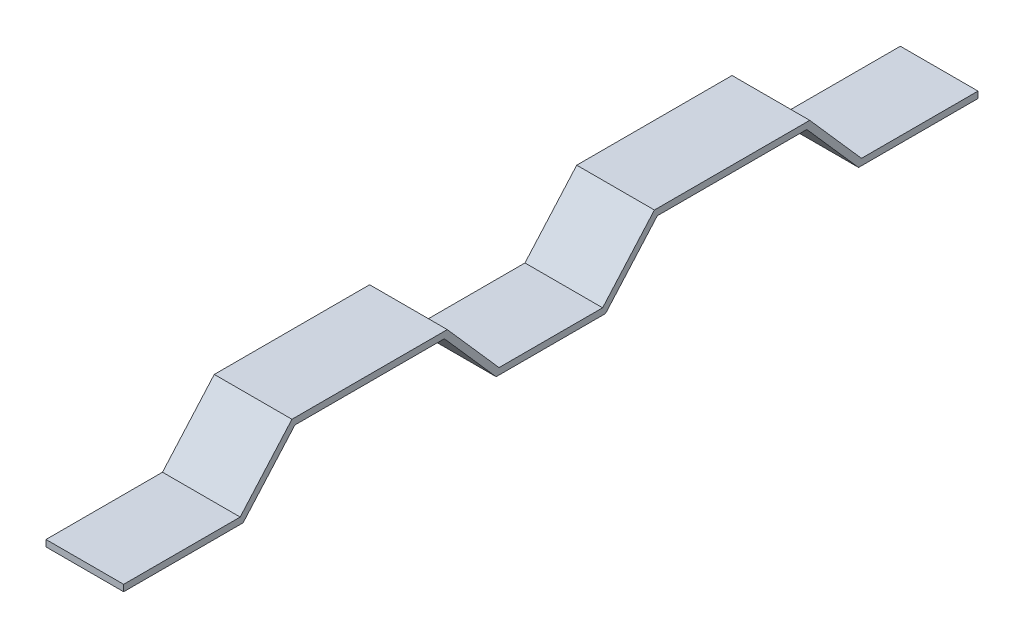
ISO-10303-21;
HEADER;
FILE_DESCRIPTION(('STEP AP214'),'2;1');
FILE_NAME('part.step','',(''),(''),'','','');
FILE_SCHEMA(('AUTOMOTIVE_DESIGN { 1 0 10303 214 1 1 1 1 }'));
ENDSEC;
DATA;
#1=APPLICATION_CONTEXT('core data for automotive mechanical design processes');
#2=APPLICATION_PROTOCOL_DEFINITION('international standard','automotive_design',2000,#1);
#3=PRODUCT_CONTEXT('',#1,'mechanical');
#4=PRODUCT('Part','Part','',(#3));
#5=PRODUCT_RELATED_PRODUCT_CATEGORY('part','',(#4));
#6=PRODUCT_DEFINITION_FORMATION('','',#4);
#7=PRODUCT_DEFINITION_CONTEXT('part definition',#1,'design');
#8=PRODUCT_DEFINITION('design','',#6,#7);
#9=PRODUCT_DEFINITION_SHAPE('','',#8);
#10=(LENGTH_UNIT() NAMED_UNIT(*) SI_UNIT(.MILLI.,.METRE.));
#11=(NAMED_UNIT(*) PLANE_ANGLE_UNIT() SI_UNIT($,.RADIAN.));
#12=(NAMED_UNIT(*) SI_UNIT($,.STERADIAN.) SOLID_ANGLE_UNIT());
#13=UNCERTAINTY_MEASURE_WITH_UNIT(LENGTH_MEASURE(1.E-05),#10,'distance_accuracy_value','');
#14=(GEOMETRIC_REPRESENTATION_CONTEXT(3) GLOBAL_UNCERTAINTY_ASSIGNED_CONTEXT((#13)) GLOBAL_UNIT_ASSIGNED_CONTEXT((#10,
#11,#12)) REPRESENTATION_CONTEXT('',''));
#15=CARTESIAN_POINT('',(0.,0.,0.));
#16=DIRECTION('',(0.,0.,1.));
#17=DIRECTION('',(1.,0.,0.));
#18=AXIS2_PLACEMENT_3D('',#15,#16,#17);
#19=CARTESIAN_POINT('',(38.1,-3.175,174.463559322034));
#20=DIRECTION('',(0.,0.,-1.));
#21=DIRECTION('',(-1.,0.,0.));
#22=AXIS2_PLACEMENT_3D('',#19,#20,#21);
#23=PLANE('',#22);
#24=DIRECTION('',(0.,-1.,0.));
#25=VECTOR('',#24,1.);
#26=CARTESIAN_POINT('',(0.,-3.175,174.463559322034));
#27=LINE('',#26,#25);
#28=CARTESIAN_POINT('',(0.,0.,174.463559322034));
#29=VERTEX_POINT('',#28);
#30=CARTESIAN_POINT('',(0.,-3.175,174.463559322034));
#31=VERTEX_POINT('',#30);
#32=EDGE_CURVE('E202',#29,#31,#27,.T.);
#33=ORIENTED_EDGE('',*,*,#32,.T.);
#34=DIRECTION('',(-1.,0.,0.));
#35=VECTOR('',#34,1.);
#36=CARTESIAN_POINT('',(38.1,-3.175,174.463559322034));
#37=LINE('',#36,#35);
#38=CARTESIAN_POINT('',(38.1,-3.175,174.463559322034));
#39=VERTEX_POINT('',#38);
#40=EDGE_CURVE('E11',#39,#31,#37,.T.);
#41=ORIENTED_EDGE('',*,*,#40,.F.);
#42=DIRECTION('',(0.,-1.,0.));
#43=VECTOR('',#42,1.);
#44=CARTESIAN_POINT('',(38.1,-3.175,174.463559322034));
#45=LINE('',#44,#43);
#46=CARTESIAN_POINT('',(38.1,0.,174.463559322034));
#47=VERTEX_POINT('',#46);
#48=EDGE_CURVE('E240',#47,#39,#45,.T.);
#49=ORIENTED_EDGE('',*,*,#48,.F.);
#50=DIRECTION('',(-1.,0.,0.));
#51=VECTOR('',#50,1.);
#52=CARTESIAN_POINT('',(38.1,0.,174.463559322034));
#53=LINE('',#52,#51);
#54=EDGE_CURVE('E198',#47,#29,#53,.T.);
#55=ORIENTED_EDGE('',*,*,#54,.T.);
#56=EDGE_LOOP('',(#33,#41,#49,#55));
#57=FACE_BOUND('',#56,.T.);
#58=ADVANCED_FACE('F34',(#57),#23,.F.);
#59=CARTESIAN_POINT('',(38.1,-3.175,174.463559322034));
#60=DIRECTION('',(0.,1.,0.));
#61=DIRECTION('',(0.,0.,1.));
#62=AXIS2_PLACEMENT_3D('',#59,#60,#61);
#63=PLANE('',#62);
#64=DIRECTION('',(0.,0.,-1.));
#65=VECTOR('',#64,1.);
#66=CARTESIAN_POINT('',(0.,-3.175,174.463559322034));
#67=LINE('',#66,#65);
#68=CARTESIAN_POINT('',(0.,-3.175,115.878892615579));
#69=VERTEX_POINT('',#68);
#70=EDGE_CURVE('E205',#31,#69,#67,.T.);
#71=ORIENTED_EDGE('',*,*,#70,.T.);
#72=DIRECTION('',(-1.,0.,0.));
#73=VECTOR('',#72,1.);
#74=CARTESIAN_POINT('',(38.1,-3.175,115.878892615579));
#75=LINE('',#74,#73);
#76=CARTESIAN_POINT('',(38.1,-3.175,115.878892615579));
#77=VERTEX_POINT('',#76);
#78=EDGE_CURVE('E42',#77,#69,#75,.T.);
#79=ORIENTED_EDGE('',*,*,#78,.F.);
#80=DIRECTION('',(0.,0.,-1.));
#81=VECTOR('',#80,1.);
#82=CARTESIAN_POINT('',(38.1,-3.175,174.463559322034));
#83=LINE('',#82,#81);
#84=EDGE_CURVE('E129',#39,#77,#83,.T.);
#85=ORIENTED_EDGE('',*,*,#84,.F.);
#86=ORIENTED_EDGE('',*,*,#40,.T.);
#87=EDGE_LOOP('',(#71,#79,#85,#86));
#88=FACE_BOUND('',#87,.T.);
#89=ADVANCED_FACE('F358',(#88),#63,.F.);
#90=CARTESIAN_POINT('',(38.1,-3.175,115.878892615579));
#91=DIRECTION('',(0.,0.660880367939409,0.750491265287126));
#92=DIRECTION('',(0.,-0.750491265287126,0.660880367939409));
#93=AXIS2_PLACEMENT_3D('',#90,#91,#92);
#94=PLANE('',#93);
#95=DIRECTION('',(0.,0.750491265287126,-0.660880367939409));
#96=VECTOR('',#95,1.);
#97=CARTESIAN_POINT('',(0.,-3.175,115.878892615579));
#98=LINE('',#97,#96);
#99=CARTESIAN_POINT('',(0.,25.6690677966102,90.4788926155794));
#100=VERTEX_POINT('',#99);
#101=EDGE_CURVE('E207',#69,#100,#98,.T.);
#102=ORIENTED_EDGE('',*,*,#101,.T.);
#103=DIRECTION('',(-1.,0.,0.));
#104=VECTOR('',#103,1.);
#105=CARTESIAN_POINT('',(38.1,25.6690677966102,90.4788926155794));
#106=LINE('',#105,#104);
#107=CARTESIAN_POINT('',(38.1,25.6690677966102,90.4788926155794));
#108=VERTEX_POINT('',#107);
#109=EDGE_CURVE('E283',#108,#100,#106,.T.);
#110=ORIENTED_EDGE('',*,*,#109,.F.);
#111=DIRECTION('',(0.,0.750491265287126,-0.660880367939409));
#112=VECTOR('',#111,1.);
#113=CARTESIAN_POINT('',(38.1,-3.175,115.878892615579));
#114=LINE('',#113,#112);
#115=EDGE_CURVE('E291',#77,#108,#114,.T.);
#116=ORIENTED_EDGE('',*,*,#115,.F.);
#117=ORIENTED_EDGE('',*,*,#78,.T.);
#118=EDGE_LOOP('',(#102,#110,#116,#117));
#119=FACE_BOUND('',#118,.T.);
#120=ADVANCED_FACE('F289',(#119),#94,.F.);
#121=CARTESIAN_POINT('',(38.1,25.6690677966102,90.4788926155794));
#122=DIRECTION('',(0.,1.,0.));
#123=DIRECTION('',(0.,0.,1.));
#124=AXIS2_PLACEMENT_3D('',#121,#122,#123);
#125=PLANE('',#124);
#126=DIRECTION('',(0.,0.,-1.));
#127=VECTOR('',#126,1.);
#128=CARTESIAN_POINT('',(0.,25.6690677966102,90.4788926155794));
#129=LINE('',#128,#127);
#130=CARTESIAN_POINT('',(0.,25.6690677966102,17.1482260284884));
#131=VERTEX_POINT('',#130);
#132=EDGE_CURVE('E209',#100,#131,#129,.T.);
#133=ORIENTED_EDGE('',*,*,#132,.T.);
#134=DIRECTION('',(-1.,0.,0.));
#135=VECTOR('',#134,1.);
#136=CARTESIAN_POINT('',(38.1,25.6690677966102,17.1482260284884));
#137=LINE('',#136,#135);
#138=CARTESIAN_POINT('',(38.1,25.6690677966102,17.1482260284884));
#139=VERTEX_POINT('',#138);
#140=EDGE_CURVE('E280',#139,#131,#137,.T.);
#141=ORIENTED_EDGE('',*,*,#140,.F.);
#142=DIRECTION('',(0.,0.,-1.));
#143=VECTOR('',#142,1.);
#144=CARTESIAN_POINT('',(38.1,25.6690677966102,90.4788926155794));
#145=LINE('',#144,#143);
#146=EDGE_CURVE('E309',#108,#139,#145,.T.);
#147=ORIENTED_EDGE('',*,*,#146,.F.);
#148=ORIENTED_EDGE('',*,*,#109,.T.);
#149=EDGE_LOOP('',(#133,#141,#147,#148));
#150=FACE_BOUND('',#149,.T.);
#151=ADVANCED_FACE('F300',(#150),#125,.F.);
#152=CARTESIAN_POINT('',(38.1,25.6690677966102,17.1482260284884));
#153=DIRECTION('',(0.,0.660880367939409,-0.750491265287126));
#154=DIRECTION('',(0.,0.750491265287126,0.660880367939409));
#155=AXIS2_PLACEMENT_3D('',#152,#153,#154);
#156=PLANE('',#155);
#157=DIRECTION('',(0.,-0.750491265287126,-0.660880367939409));
#158=VECTOR('',#157,1.);
#159=CARTESIAN_POINT('',(0.,25.6690677966102,17.1482260284884));
#160=LINE('',#159,#158);
#161=CARTESIAN_POINT('',(0.,-3.175,-8.25177397151158));
#162=VERTEX_POINT('',#161);
#163=EDGE_CURVE('E211',#131,#162,#160,.T.);
#164=ORIENTED_EDGE('',*,*,#163,.T.);
#165=DIRECTION('',(-1.,0.,0.));
#166=VECTOR('',#165,1.);
#167=CARTESIAN_POINT('',(38.1,-3.175,-8.25177397151158));
#168=LINE('',#167,#166);
#169=CARTESIAN_POINT('',(38.1,-3.175,-8.25177397151158));
#170=VERTEX_POINT('',#169);
#171=EDGE_CURVE('E277',#170,#162,#168,.T.);
#172=ORIENTED_EDGE('',*,*,#171,.F.);
#173=DIRECTION('',(0.,-0.750491265287126,-0.660880367939409));
#174=VECTOR('',#173,1.);
#175=CARTESIAN_POINT('',(38.1,25.6690677966102,17.1482260284884));
#176=LINE('',#175,#174);
#177=EDGE_CURVE('E306',#139,#170,#176,.T.);
#178=ORIENTED_EDGE('',*,*,#177,.F.);
#179=ORIENTED_EDGE('',*,*,#140,.T.);
#180=EDGE_LOOP('',(#164,#172,#178,#179));
#181=FACE_BOUND('',#180,.T.);
#182=ADVANCED_FACE('F304',(#181),#156,.F.);
#183=CARTESIAN_POINT('',(38.1,-3.175,-8.25177397151158));
#184=DIRECTION('',(0.,1.,0.));
#185=DIRECTION('',(0.,0.,1.));
#186=AXIS2_PLACEMENT_3D('',#183,#184,#185);
#187=PLANE('',#186);
#188=DIRECTION('',(0.,0.,-1.));
#189=VECTOR('',#188,1.);
#190=CARTESIAN_POINT('',(0.,-3.175,-8.25177397151158));
#191=LINE('',#190,#189);
#192=CARTESIAN_POINT('',(0.,-3.175,-61.9211073844206));
#193=VERTEX_POINT('',#192);
#194=EDGE_CURVE('E213',#162,#193,#191,.T.);
#195=ORIENTED_EDGE('',*,*,#194,.T.);
#196=DIRECTION('',(-1.,0.,0.));
#197=VECTOR('',#196,1.);
#198=CARTESIAN_POINT('',(38.1,-3.175,-61.9211073844206));
#199=LINE('',#198,#197);
#200=CARTESIAN_POINT('',(38.1,-3.175,-61.9211073844206));
#201=VERTEX_POINT('',#200);
#202=EDGE_CURVE('E274',#201,#193,#199,.T.);
#203=ORIENTED_EDGE('',*,*,#202,.F.);
#204=DIRECTION('',(0.,0.,-1.));
#205=VECTOR('',#204,1.);
#206=CARTESIAN_POINT('',(38.1,-3.175,-8.25177397151158));
#207=LINE('',#206,#205);
#208=EDGE_CURVE('E308',#170,#201,#207,.T.);
#209=ORIENTED_EDGE('',*,*,#208,.F.);
#210=ORIENTED_EDGE('',*,*,#171,.T.);
#211=EDGE_LOOP('',(#195,#203,#209,#210));
#212=FACE_BOUND('',#211,.T.);
#213=ADVANCED_FACE('F371',(#212),#187,.F.);
#214=CARTESIAN_POINT('',(38.1,-3.175,-61.9211073844206));
#215=DIRECTION('',(0.,0.660880367939409,0.750491265287126));
#216=DIRECTION('',(0.,-0.750491265287126,0.660880367939409));
#217=AXIS2_PLACEMENT_3D('',#214,#215,#216);
#218=PLANE('',#217);
#219=DIRECTION('',(0.,0.750491265287126,-0.660880367939409));
#220=VECTOR('',#219,1.);
#221=CARTESIAN_POINT('',(0.,-3.175,-61.9211073844206));
#222=LINE('',#221,#220);
#223=CARTESIAN_POINT('',(0.,25.6690677966102,-87.3211073844206));
#224=VERTEX_POINT('',#223);
#225=EDGE_CURVE('E215',#193,#224,#222,.T.);
#226=ORIENTED_EDGE('',*,*,#225,.T.);
#227=DIRECTION('',(-1.,0.,0.));
#228=VECTOR('',#227,1.);
#229=CARTESIAN_POINT('',(38.1,25.6690677966102,-87.3211073844206));
#230=LINE('',#229,#228);
#231=CARTESIAN_POINT('',(38.1,25.6690677966102,-87.3211073844206));
#232=VERTEX_POINT('',#231);
#233=EDGE_CURVE('E271',#232,#224,#230,.T.);
#234=ORIENTED_EDGE('',*,*,#233,.F.);
#235=DIRECTION('',(0.,0.750491265287126,-0.660880367939409));
#236=VECTOR('',#235,1.);
#237=CARTESIAN_POINT('',(38.1,-3.175,-61.9211073844206));
#238=LINE('',#237,#236);
#239=EDGE_CURVE('E311',#201,#232,#238,.T.);
#240=ORIENTED_EDGE('',*,*,#239,.F.);
#241=ORIENTED_EDGE('',*,*,#202,.T.);
#242=EDGE_LOOP('',(#226,#234,#240,#241));
#243=FACE_BOUND('',#242,.T.);
#244=ADVANCED_FACE('F374',(#243),#218,.F.);
#245=CARTESIAN_POINT('',(38.1,25.6690677966102,-87.3211073844206));
#246=DIRECTION('',(0.,1.,0.));
#247=DIRECTION('',(0.,0.,1.));
#248=AXIS2_PLACEMENT_3D('',#245,#246,#247);
#249=PLANE('',#248);
#250=DIRECTION('',(0.,0.,-1.));
#251=VECTOR('',#250,1.);
#252=CARTESIAN_POINT('',(0.,25.6690677966102,-87.3211073844206));
#253=LINE('',#252,#251);
#254=CARTESIAN_POINT('',(0.,25.6690677966102,-160.651773971512));
#255=VERTEX_POINT('',#254);
#256=EDGE_CURVE('E217',#224,#255,#253,.T.);
#257=ORIENTED_EDGE('',*,*,#256,.T.);
#258=DIRECTION('',(-1.,0.,0.));
#259=VECTOR('',#258,1.);
#260=CARTESIAN_POINT('',(38.1,25.6690677966102,-160.651773971512));
#261=LINE('',#260,#259);
#262=CARTESIAN_POINT('',(38.1,25.6690677966102,-160.651773971512));
#263=VERTEX_POINT('',#262);
#264=EDGE_CURVE('E268',#263,#255,#261,.T.);
#265=ORIENTED_EDGE('',*,*,#264,.F.);
#266=DIRECTION('',(0.,0.,-1.));
#267=VECTOR('',#266,1.);
#268=CARTESIAN_POINT('',(38.1,25.6690677966102,-87.3211073844206));
#269=LINE('',#268,#267);
#270=EDGE_CURVE('E317',#232,#263,#269,.T.);
#271=ORIENTED_EDGE('',*,*,#270,.F.);
#272=ORIENTED_EDGE('',*,*,#233,.T.);
#273=EDGE_LOOP('',(#257,#265,#271,#272));
#274=FACE_BOUND('',#273,.T.);
#275=ADVANCED_FACE('F378',(#274),#249,.F.);
#276=CARTESIAN_POINT('',(38.1,25.6690677966102,-160.651773971512));
#277=DIRECTION('',(0.,0.660880367939409,-0.750491265287126));
#278=DIRECTION('',(0.,0.750491265287126,0.660880367939409));
#279=AXIS2_PLACEMENT_3D('',#276,#277,#278);
#280=PLANE('',#279);
#281=DIRECTION('',(0.,-0.750491265287126,-0.660880367939409));
#282=VECTOR('',#281,1.);
#283=CARTESIAN_POINT('',(0.,25.6690677966102,-160.651773971512));
#284=LINE('',#283,#282);
#285=CARTESIAN_POINT('',(0.,-3.175,-186.051773971512));
#286=VERTEX_POINT('',#285);
#287=EDGE_CURVE('E219',#255,#286,#284,.T.);
#288=ORIENTED_EDGE('',*,*,#287,.T.);
#289=DIRECTION('',(-1.,0.,0.));
#290=VECTOR('',#289,1.);
#291=CARTESIAN_POINT('',(38.1,-3.175,-186.051773971512));
#292=LINE('',#291,#290);
#293=CARTESIAN_POINT('',(38.1,-3.175,-186.051773971512));
#294=VERTEX_POINT('',#293);
#295=EDGE_CURVE('E265',#294,#286,#292,.T.);
#296=ORIENTED_EDGE('',*,*,#295,.F.);
#297=DIRECTION('',(0.,-0.750491265287126,-0.660880367939409));
#298=VECTOR('',#297,1.);
#299=CARTESIAN_POINT('',(38.1,25.6690677966102,-160.651773971512));
#300=LINE('',#299,#298);
#301=EDGE_CURVE('E319',#263,#294,#300,.T.);
#302=ORIENTED_EDGE('',*,*,#301,.F.);
#303=ORIENTED_EDGE('',*,*,#264,.T.);
#304=EDGE_LOOP('',(#288,#296,#302,#303));
#305=FACE_BOUND('',#304,.T.);
#306=ADVANCED_FACE('F382',(#305),#280,.F.);
#307=CARTESIAN_POINT('',(38.1,-3.175,-186.051773971512));
#308=DIRECTION('',(0.,1.,0.));
#309=DIRECTION('',(0.,0.,1.));
#310=AXIS2_PLACEMENT_3D('',#307,#308,#309);
#311=PLANE('',#310);
#312=DIRECTION('',(0.,0.,-1.));
#313=VECTOR('',#312,1.);
#314=CARTESIAN_POINT('',(0.,-3.175,-186.051773971512));
#315=LINE('',#314,#313);
#316=CARTESIAN_POINT('',(0.,-3.175,-244.636440677966));
#317=VERTEX_POINT('',#316);
#318=EDGE_CURVE('E221',#286,#317,#315,.T.);
#319=ORIENTED_EDGE('',*,*,#318,.T.);
#320=DIRECTION('',(-1.,0.,0.));
#321=VECTOR('',#320,1.);
#322=CARTESIAN_POINT('',(38.1,-3.175,-244.636440677966));
#323=LINE('',#322,#321);
#324=CARTESIAN_POINT('',(38.1,-3.175,-244.636440677966));
#325=VERTEX_POINT('',#324);
#326=EDGE_CURVE('E262',#325,#317,#323,.T.);
#327=ORIENTED_EDGE('',*,*,#326,.F.);
#328=DIRECTION('',(0.,0.,-1.));
#329=VECTOR('',#328,1.);
#330=CARTESIAN_POINT('',(38.1,-3.175,-186.051773971512));
#331=LINE('',#330,#329);
#332=EDGE_CURVE('E321',#294,#325,#331,.T.);
#333=ORIENTED_EDGE('',*,*,#332,.F.);
#334=ORIENTED_EDGE('',*,*,#295,.T.);
#335=EDGE_LOOP('',(#319,#327,#333,#334));
#336=FACE_BOUND('',#335,.T.);
#337=ADVANCED_FACE('F386',(#336),#311,.F.);
#338=CARTESIAN_POINT('',(38.1,-3.175,-244.636440677966));
#339=DIRECTION('',(0.,0.,1.));
#340=DIRECTION('',(1.,0.,0.));
#341=AXIS2_PLACEMENT_3D('',#338,#339,#340);
#342=PLANE('',#341);
#343=DIRECTION('',(0.,1.,0.));
#344=VECTOR('',#343,1.);
#345=CARTESIAN_POINT('',(0.,-3.175,-244.636440677966));
#346=LINE('',#345,#344);
#347=CARTESIAN_POINT('',(0.,0.,-244.636440677966));
#348=VERTEX_POINT('',#347);
#349=EDGE_CURVE('E223',#317,#348,#346,.T.);
#350=ORIENTED_EDGE('',*,*,#349,.T.);
#351=DIRECTION('',(-1.,0.,0.));
#352=VECTOR('',#351,1.);
#353=CARTESIAN_POINT('',(38.1,0.,-244.636440677966));
#354=LINE('',#353,#352);
#355=CARTESIAN_POINT('',(38.1,0.,-244.636440677966));
#356=VERTEX_POINT('',#355);
#357=EDGE_CURVE('E259',#356,#348,#354,.T.);
#358=ORIENTED_EDGE('',*,*,#357,.F.);
#359=DIRECTION('',(0.,1.,0.));
#360=VECTOR('',#359,1.);
#361=CARTESIAN_POINT('',(38.1,-3.175,-244.636440677966));
#362=LINE('',#361,#360);
#363=EDGE_CURVE('E323',#325,#356,#362,.T.);
#364=ORIENTED_EDGE('',*,*,#363,.F.);
#365=ORIENTED_EDGE('',*,*,#326,.T.);
#366=EDGE_LOOP('',(#350,#358,#364,#365));
#367=FACE_BOUND('',#366,.T.);
#368=ADVANCED_FACE('F390',(#367),#342,.F.);
#369=CARTESIAN_POINT('',(38.1,0.,-187.486440677966));
#370=DIRECTION('',(0.,-1.,0.));
#371=DIRECTION('',(0.,0.,-1.));
#372=AXIS2_PLACEMENT_3D('',#369,#370,#371);
#373=PLANE('',#372);
#374=DIRECTION('',(0.,0.,1.));
#375=VECTOR('',#374,1.);
#376=CARTESIAN_POINT('',(0.,0.,-187.486440677966));
#377=LINE('',#376,#375);
#378=CARTESIAN_POINT('',(0.,0.,-187.486440677966));
#379=VERTEX_POINT('',#378);
#380=EDGE_CURVE('E225',#348,#379,#377,.T.);
#381=ORIENTED_EDGE('',*,*,#380,.T.);
#382=DIRECTION('',(-1.,0.,0.));
#383=VECTOR('',#382,1.);
#384=CARTESIAN_POINT('',(38.1,0.,-187.486440677966));
#385=LINE('',#384,#383);
#386=CARTESIAN_POINT('',(38.1,0.,-187.486440677966));
#387=VERTEX_POINT('',#386);
#388=EDGE_CURVE('E256',#387,#379,#385,.T.);
#389=ORIENTED_EDGE('',*,*,#388,.F.);
#390=DIRECTION('',(0.,0.,1.));
#391=VECTOR('',#390,1.);
#392=CARTESIAN_POINT('',(38.1,0.,-187.486440677966));
#393=LINE('',#392,#391);
#394=EDGE_CURVE('E325',#356,#387,#393,.T.);
#395=ORIENTED_EDGE('',*,*,#394,.F.);
#396=ORIENTED_EDGE('',*,*,#357,.T.);
#397=EDGE_LOOP('',(#381,#389,#395,#396));
#398=FACE_BOUND('',#397,.T.);
#399=ADVANCED_FACE('F394',(#398),#373,.F.);
#400=CARTESIAN_POINT('',(38.1,28.8440677966102,-162.086440677966));
#401=DIRECTION('',(0.,-0.660880367939409,0.750491265287126));
#402=DIRECTION('',(0.,-0.750491265287126,-0.660880367939409));
#403=AXIS2_PLACEMENT_3D('',#400,#401,#402);
#404=PLANE('',#403);
#405=DIRECTION('',(0.,0.750491265287126,0.660880367939409));
#406=VECTOR('',#405,1.);
#407=CARTESIAN_POINT('',(0.,28.8440677966102,-162.086440677966));
#408=LINE('',#407,#406);
#409=CARTESIAN_POINT('',(0.,28.8440677966102,-162.086440677966));
#410=VERTEX_POINT('',#409);
#411=EDGE_CURVE('E227',#379,#410,#408,.T.);
#412=ORIENTED_EDGE('',*,*,#411,.T.);
#413=DIRECTION('',(-1.,0.,0.));
#414=VECTOR('',#413,1.);
#415=CARTESIAN_POINT('',(38.1,28.8440677966102,-162.086440677966));
#416=LINE('',#415,#414);
#417=CARTESIAN_POINT('',(38.1,28.8440677966102,-162.086440677966));
#418=VERTEX_POINT('',#417);
#419=EDGE_CURVE('E253',#418,#410,#416,.T.);
#420=ORIENTED_EDGE('',*,*,#419,.F.);
#421=DIRECTION('',(0.,0.750491265287126,0.660880367939409));
#422=VECTOR('',#421,1.);
#423=CARTESIAN_POINT('',(38.1,28.8440677966102,-162.086440677966));
#424=LINE('',#423,#422);
#425=EDGE_CURVE('E327',#387,#418,#424,.T.);
#426=ORIENTED_EDGE('',*,*,#425,.F.);
#427=ORIENTED_EDGE('',*,*,#388,.T.);
#428=EDGE_LOOP('',(#412,#420,#426,#427));
#429=FACE_BOUND('',#428,.T.);
#430=ADVANCED_FACE('F398',(#429),#404,.F.);
#431=CARTESIAN_POINT('',(38.1,28.8440677966102,-85.8864406779661));
#432=DIRECTION('',(0.,-1.,0.));
#433=DIRECTION('',(0.,0.,-1.));
#434=AXIS2_PLACEMENT_3D('',#431,#432,#433);
#435=PLANE('',#434);
#436=DIRECTION('',(0.,0.,1.));
#437=VECTOR('',#436,1.);
#438=CARTESIAN_POINT('',(0.,28.8440677966102,-85.8864406779661));
#439=LINE('',#438,#437);
#440=CARTESIAN_POINT('',(0.,28.8440677966102,-85.8864406779661));
#441=VERTEX_POINT('',#440);
#442=EDGE_CURVE('E229',#410,#441,#439,.T.);
#443=ORIENTED_EDGE('',*,*,#442,.T.);
#444=DIRECTION('',(-1.,0.,0.));
#445=VECTOR('',#444,1.);
#446=CARTESIAN_POINT('',(38.1,28.8440677966102,-85.8864406779661));
#447=LINE('',#446,#445);
#448=CARTESIAN_POINT('',(38.1,28.8440677966102,-85.8864406779661));
#449=VERTEX_POINT('',#448);
#450=EDGE_CURVE('E250',#449,#441,#447,.T.);
#451=ORIENTED_EDGE('',*,*,#450,.F.);
#452=DIRECTION('',(0.,0.,1.));
#453=VECTOR('',#452,1.);
#454=CARTESIAN_POINT('',(38.1,28.8440677966102,-85.8864406779661));
#455=LINE('',#454,#453);
#456=EDGE_CURVE('E329',#418,#449,#455,.T.);
#457=ORIENTED_EDGE('',*,*,#456,.F.);
#458=ORIENTED_EDGE('',*,*,#419,.T.);
#459=EDGE_LOOP('',(#443,#451,#457,#458));
#460=FACE_BOUND('',#459,.T.);
#461=ADVANCED_FACE('F402',(#460),#435,.F.);
#462=CARTESIAN_POINT('',(38.1,0.,-60.4864406779661));
#463=DIRECTION('',(0.,-0.660880367939409,-0.750491265287126));
#464=DIRECTION('',(0.,0.750491265287126,-0.660880367939409));
#465=AXIS2_PLACEMENT_3D('',#462,#463,#464);
#466=PLANE('',#465);
#467=DIRECTION('',(0.,-0.750491265287126,0.660880367939409));
#468=VECTOR('',#467,1.);
#469=CARTESIAN_POINT('',(0.,0.,-60.4864406779661));
#470=LINE('',#469,#468);
#471=CARTESIAN_POINT('',(0.,0.,-60.4864406779661));
#472=VERTEX_POINT('',#471);
#473=EDGE_CURVE('E231',#441,#472,#470,.T.);
#474=ORIENTED_EDGE('',*,*,#473,.T.);
#475=DIRECTION('',(-1.,0.,0.));
#476=VECTOR('',#475,1.);
#477=CARTESIAN_POINT('',(38.1,0.,-60.4864406779661));
#478=LINE('',#477,#476);
#479=CARTESIAN_POINT('',(38.1,0.,-60.4864406779661));
#480=VERTEX_POINT('',#479);
#481=EDGE_CURVE('E247',#480,#472,#478,.T.);
#482=ORIENTED_EDGE('',*,*,#481,.F.);
#483=DIRECTION('',(0.,-0.750491265287126,0.660880367939409));
#484=VECTOR('',#483,1.);
#485=CARTESIAN_POINT('',(38.1,0.,-60.4864406779661));
#486=LINE('',#485,#484);
#487=EDGE_CURVE('E331',#449,#480,#486,.T.);
#488=ORIENTED_EDGE('',*,*,#487,.F.);
#489=ORIENTED_EDGE('',*,*,#450,.T.);
#490=EDGE_LOOP('',(#474,#482,#488,#489));
#491=FACE_BOUND('',#490,.T.);
#492=ADVANCED_FACE('F406',(#491),#466,.F.);
#493=CARTESIAN_POINT('',(38.1,0.,-9.68644067796611));
#494=DIRECTION('',(0.,-1.,0.));
#495=DIRECTION('',(0.,0.,-1.));
#496=AXIS2_PLACEMENT_3D('',#493,#494,#495);
#497=PLANE('',#496);
#498=DIRECTION('',(0.,0.,1.));
#499=VECTOR('',#498,1.);
#500=CARTESIAN_POINT('',(0.,0.,-9.68644067796611));
#501=LINE('',#500,#499);
#502=CARTESIAN_POINT('',(0.,0.,-9.68644067796611));
#503=VERTEX_POINT('',#502);
#504=EDGE_CURVE('E233',#472,#503,#501,.T.);
#505=ORIENTED_EDGE('',*,*,#504,.T.);
#506=DIRECTION('',(-1.,0.,0.));
#507=VECTOR('',#506,1.);
#508=CARTESIAN_POINT('',(38.1,0.,-9.68644067796611));
#509=LINE('',#508,#507);
#510=CARTESIAN_POINT('',(38.1,0.,-9.68644067796611));
#511=VERTEX_POINT('',#510);
#512=EDGE_CURVE('E244',#511,#503,#509,.T.);
#513=ORIENTED_EDGE('',*,*,#512,.F.);
#514=DIRECTION('',(0.,0.,1.));
#515=VECTOR('',#514,1.);
#516=CARTESIAN_POINT('',(38.1,0.,-9.68644067796611));
#517=LINE('',#516,#515);
#518=EDGE_CURVE('E333',#480,#511,#517,.T.);
#519=ORIENTED_EDGE('',*,*,#518,.F.);
#520=ORIENTED_EDGE('',*,*,#481,.T.);
#521=EDGE_LOOP('',(#505,#513,#519,#520));
#522=FACE_BOUND('',#521,.T.);
#523=ADVANCED_FACE('F339',(#522),#497,.F.);
#524=CARTESIAN_POINT('',(38.1,28.8440677966102,15.7135593220339));
#525=DIRECTION('',(0.,-0.660880367939409,0.750491265287126));
#526=DIRECTION('',(0.,-0.750491265287126,-0.660880367939409));
#527=AXIS2_PLACEMENT_3D('',#524,#525,#526);
#528=PLANE('',#527);
#529=DIRECTION('',(0.,0.750491265287126,0.660880367939409));
#530=VECTOR('',#529,1.);
#531=CARTESIAN_POINT('',(0.,28.8440677966102,15.7135593220339));
#532=LINE('',#531,#530);
#533=CARTESIAN_POINT('',(0.,28.8440677966102,15.7135593220339));
#534=VERTEX_POINT('',#533);
#535=EDGE_CURVE('E235',#503,#534,#532,.T.);
#536=ORIENTED_EDGE('',*,*,#535,.T.);
#537=DIRECTION('',(-1.,0.,0.));
#538=VECTOR('',#537,1.);
#539=CARTESIAN_POINT('',(38.1,28.8440677966102,15.7135593220339));
#540=LINE('',#539,#538);
#541=CARTESIAN_POINT('',(38.1,28.8440677966102,15.7135593220339));
#542=VERTEX_POINT('',#541);
#543=EDGE_CURVE('E193',#542,#534,#540,.T.);
#544=ORIENTED_EDGE('',*,*,#543,.F.);
#545=DIRECTION('',(0.,0.750491265287126,0.660880367939409));
#546=VECTOR('',#545,1.);
#547=CARTESIAN_POINT('',(38.1,28.8440677966102,15.7135593220339));
#548=LINE('',#547,#546);
#549=EDGE_CURVE('E184',#511,#542,#548,.T.);
#550=ORIENTED_EDGE('',*,*,#549,.F.);
#551=ORIENTED_EDGE('',*,*,#512,.T.);
#552=EDGE_LOOP('',(#536,#544,#550,#551));
#553=FACE_BOUND('',#552,.T.);
#554=ADVANCED_FACE('F343',(#553),#528,.F.);
#555=CARTESIAN_POINT('',(38.1,28.8440677966102,91.9135593220339));
#556=DIRECTION('',(0.,-1.,0.));
#557=DIRECTION('',(0.,0.,-1.));
#558=AXIS2_PLACEMENT_3D('',#555,#556,#557);
#559=PLANE('',#558);
#560=DIRECTION('',(0.,0.,1.));
#561=VECTOR('',#560,1.);
#562=CARTESIAN_POINT('',(0.,28.8440677966102,91.9135593220339));
#563=LINE('',#562,#561);
#564=CARTESIAN_POINT('',(0.,28.8440677966102,91.9135593220339));
#565=VERTEX_POINT('',#564);
#566=EDGE_CURVE('E192',#534,#565,#563,.T.);
#567=ORIENTED_EDGE('',*,*,#566,.T.);
#568=DIRECTION('',(-1.,0.,0.));
#569=VECTOR('',#568,1.);
#570=CARTESIAN_POINT('',(38.1,28.8440677966102,91.9135593220339));
#571=LINE('',#570,#569);
#572=CARTESIAN_POINT('',(38.1,28.8440677966102,91.9135593220339));
#573=VERTEX_POINT('',#572);
#574=EDGE_CURVE('E189',#573,#565,#571,.T.);
#575=ORIENTED_EDGE('',*,*,#574,.F.);
#576=DIRECTION('',(0.,0.,1.));
#577=VECTOR('',#576,1.);
#578=CARTESIAN_POINT('',(38.1,28.8440677966102,91.9135593220339));
#579=LINE('',#578,#577);
#580=EDGE_CURVE('E178',#542,#573,#579,.T.);
#581=ORIENTED_EDGE('',*,*,#580,.F.);
#582=ORIENTED_EDGE('',*,*,#543,.T.);
#583=EDGE_LOOP('',(#567,#575,#581,#582));
#584=FACE_BOUND('',#583,.T.);
#585=ADVANCED_FACE('F190',(#584),#559,.F.);
#586=CARTESIAN_POINT('',(38.1,0.,117.313559322034));
#587=DIRECTION('',(0.,-0.660880367939409,-0.750491265287126));
#588=DIRECTION('',(0.,0.750491265287126,-0.660880367939409));
#589=AXIS2_PLACEMENT_3D('',#586,#587,#588);
#590=PLANE('',#589);
#591=DIRECTION('',(0.,-0.750491265287126,0.660880367939409));
#592=VECTOR('',#591,1.);
#593=CARTESIAN_POINT('',(0.,0.,117.313559322034));
#594=LINE('',#593,#592);
#595=CARTESIAN_POINT('',(0.,0.,117.313559322034));
#596=VERTEX_POINT('',#595);
#597=EDGE_CURVE('E115',#565,#596,#594,.T.);
#598=ORIENTED_EDGE('',*,*,#597,.T.);
#599=DIRECTION('',(-1.,0.,0.));
#600=VECTOR('',#599,1.);
#601=CARTESIAN_POINT('',(38.1,0.,117.313559322034));
#602=LINE('',#601,#600);
#603=CARTESIAN_POINT('',(38.1,0.,117.313559322034));
#604=VERTEX_POINT('',#603);
#605=EDGE_CURVE('E194',#604,#596,#602,.T.);
#606=ORIENTED_EDGE('',*,*,#605,.F.);
#607=DIRECTION('',(0.,-0.750491265287126,0.660880367939409));
#608=VECTOR('',#607,1.);
#609=CARTESIAN_POINT('',(38.1,0.,117.313559322034));
#610=LINE('',#609,#608);
#611=EDGE_CURVE('E182',#573,#604,#610,.T.);
#612=ORIENTED_EDGE('',*,*,#611,.F.);
#613=ORIENTED_EDGE('',*,*,#574,.T.);
#614=EDGE_LOOP('',(#598,#606,#612,#613));
#615=FACE_BOUND('',#614,.T.);
#616=ADVANCED_FACE('F196',(#615),#590,.F.);
#617=CARTESIAN_POINT('',(38.1,0.,174.463559322034));
#618=DIRECTION('',(0.,-1.,0.));
#619=DIRECTION('',(0.,0.,-1.));
#620=AXIS2_PLACEMENT_3D('',#617,#618,#619);
#621=PLANE('',#620);
#622=DIRECTION('',(0.,0.,1.));
#623=VECTOR('',#622,1.);
#624=CARTESIAN_POINT('',(0.,0.,174.463559322034));
#625=LINE('',#624,#623);
#626=EDGE_CURVE('E121',#596,#29,#625,.T.);
#627=ORIENTED_EDGE('',*,*,#626,.T.);
#628=ORIENTED_EDGE('',*,*,#54,.F.);
#629=DIRECTION('',(0.,0.,1.));
#630=VECTOR('',#629,1.);
#631=CARTESIAN_POINT('',(38.1,0.,174.463559322034));
#632=LINE('',#631,#630);
#633=EDGE_CURVE('E50',#604,#47,#632,.T.);
#634=ORIENTED_EDGE('',*,*,#633,.F.);
#635=ORIENTED_EDGE('',*,*,#605,.T.);
#636=EDGE_LOOP('',(#627,#628,#634,#635));
#637=FACE_BOUND('',#636,.T.);
#638=ADVANCED_FACE('F347',(#637),#621,.F.);
#639=CARTESIAN_POINT('',(38.1,0.,0.));
#640=DIRECTION('',(-1.,0.,0.));
#641=DIRECTION('',(0.,0.,1.));
#642=AXIS2_PLACEMENT_3D('',#639,#640,#641);
#643=PLANE('',#642);
#644=ORIENTED_EDGE('',*,*,#48,.T.);
#645=ORIENTED_EDGE('',*,*,#84,.T.);
#646=ORIENTED_EDGE('',*,*,#115,.T.);
#647=ORIENTED_EDGE('',*,*,#146,.T.);
#648=ORIENTED_EDGE('',*,*,#177,.T.);
#649=ORIENTED_EDGE('',*,*,#208,.T.);
#650=ORIENTED_EDGE('',*,*,#239,.T.);
#651=ORIENTED_EDGE('',*,*,#270,.T.);
#652=ORIENTED_EDGE('',*,*,#301,.T.);
#653=ORIENTED_EDGE('',*,*,#332,.T.);
#654=ORIENTED_EDGE('',*,*,#363,.T.);
#655=ORIENTED_EDGE('',*,*,#394,.T.);
#656=ORIENTED_EDGE('',*,*,#425,.T.);
#657=ORIENTED_EDGE('',*,*,#456,.T.);
#658=ORIENTED_EDGE('',*,*,#487,.T.);
#659=ORIENTED_EDGE('',*,*,#518,.T.);
#660=ORIENTED_EDGE('',*,*,#549,.T.);
#661=ORIENTED_EDGE('',*,*,#580,.T.);
#662=ORIENTED_EDGE('',*,*,#611,.T.);
#663=ORIENTED_EDGE('',*,*,#633,.T.);
#664=EDGE_LOOP('',(#644,#645,#646,#647,#648,#649,#650,#651,#652,#653,#654,#655,#656,#657,#658,
#659,#660,#661,#662,#663));
#665=FACE_BOUND('',#664,.T.);
#666=ADVANCED_FACE('F180',(#665),#643,.F.);
#667=CARTESIAN_POINT('',(0.,0.,0.));
#668=DIRECTION('',(-1.,0.,0.));
#669=DIRECTION('',(0.,0.,1.));
#670=AXIS2_PLACEMENT_3D('',#667,#668,#669);
#671=PLANE('',#670);
#672=ORIENTED_EDGE('',*,*,#32,.F.);
#673=ORIENTED_EDGE('',*,*,#626,.F.);
#674=ORIENTED_EDGE('',*,*,#597,.F.);
#675=ORIENTED_EDGE('',*,*,#566,.F.);
#676=ORIENTED_EDGE('',*,*,#535,.F.);
#677=ORIENTED_EDGE('',*,*,#504,.F.);
#678=ORIENTED_EDGE('',*,*,#473,.F.);
#679=ORIENTED_EDGE('',*,*,#442,.F.);
#680=ORIENTED_EDGE('',*,*,#411,.F.);
#681=ORIENTED_EDGE('',*,*,#380,.F.);
#682=ORIENTED_EDGE('',*,*,#349,.F.);
#683=ORIENTED_EDGE('',*,*,#318,.F.);
#684=ORIENTED_EDGE('',*,*,#287,.F.);
#685=ORIENTED_EDGE('',*,*,#256,.F.);
#686=ORIENTED_EDGE('',*,*,#225,.F.);
#687=ORIENTED_EDGE('',*,*,#194,.F.);
#688=ORIENTED_EDGE('',*,*,#163,.F.);
#689=ORIENTED_EDGE('',*,*,#132,.F.);
#690=ORIENTED_EDGE('',*,*,#101,.F.);
#691=ORIENTED_EDGE('',*,*,#70,.F.);
#692=EDGE_LOOP('',(#672,#673,#674,#675,#676,#677,#678,#679,#680,#681,#682,#683,#684,#685,#686,
#687,#688,#689,#690,#691));
#693=FACE_BOUND('',#692,.T.);
#694=ADVANCED_FACE('F295',(#693),#671,.T.);
#695=CLOSED_SHELL('',(#58,#89,#120,#151,#182,#213,#244,#275,#306,#337,#368,#399,#430,#461,#492,
#523,#554,#585,#616,#638,#666,#694));
#696=MANIFOLD_SOLID_BREP('B2',#695);
#697=ADVANCED_BREP_SHAPE_REPRESENTATION('',(#18,#696),#14);
#698=SHAPE_DEFINITION_REPRESENTATION(#9,#697);
ENDSEC;
END-ISO-10303-21;
